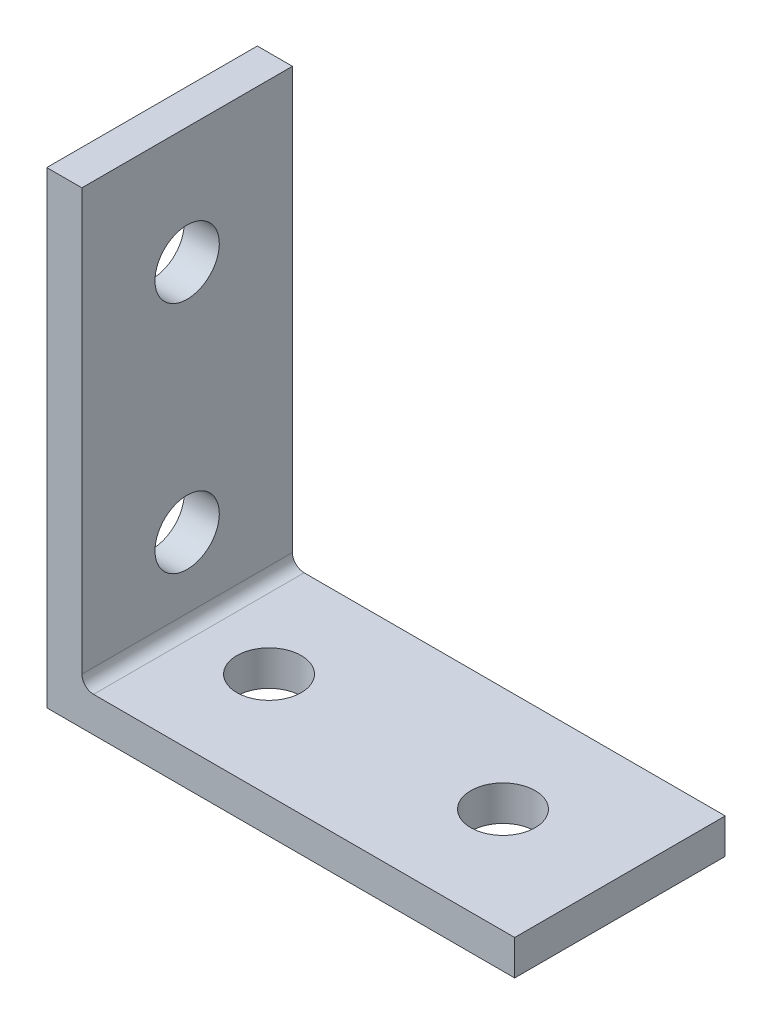
ISO-10303-21;
HEADER;
FILE_DESCRIPTION(('STEP AP214'),'2;1');
FILE_NAME('part.step','',(''),(''),'','','');
FILE_SCHEMA(('AUTOMOTIVE_DESIGN { 1 0 10303 214 1 1 1 1 }'));
ENDSEC;
DATA;
#1=APPLICATION_CONTEXT('core data for automotive mechanical design processes');
#2=APPLICATION_PROTOCOL_DEFINITION('international standard','automotive_design',2000,#1);
#3=PRODUCT_CONTEXT('',#1,'mechanical');
#4=PRODUCT('Part','Part','',(#3));
#5=PRODUCT_RELATED_PRODUCT_CATEGORY('part','',(#4));
#6=PRODUCT_DEFINITION_FORMATION('','',#4);
#7=PRODUCT_DEFINITION_CONTEXT('part definition',#1,'design');
#8=PRODUCT_DEFINITION('design','',#6,#7);
#9=PRODUCT_DEFINITION_SHAPE('','',#8);
#10=(LENGTH_UNIT() NAMED_UNIT(*) SI_UNIT(.MILLI.,.METRE.));
#11=(NAMED_UNIT(*) PLANE_ANGLE_UNIT() SI_UNIT($,.RADIAN.));
#12=(NAMED_UNIT(*) SI_UNIT($,.STERADIAN.) SOLID_ANGLE_UNIT());
#13=UNCERTAINTY_MEASURE_WITH_UNIT(LENGTH_MEASURE(1.E-05),#10,'distance_accuracy_value','');
#14=(GEOMETRIC_REPRESENTATION_CONTEXT(3) GLOBAL_UNCERTAINTY_ASSIGNED_CONTEXT((#13)) GLOBAL_UNIT_ASSIGNED_CONTEXT((#10,
#11,#12)) REPRESENTATION_CONTEXT('',''));
#15=CARTESIAN_POINT('',(0.,0.,0.));
#16=DIRECTION('',(0.,0.,1.));
#17=DIRECTION('',(1.,0.,0.));
#18=AXIS2_PLACEMENT_3D('',#15,#16,#17);
#19=CARTESIAN_POINT('',(40.,0.,9.));
#20=DIRECTION('',(0.,1.,0.));
#21=DIRECTION('',(-1.,0.,0.));
#22=AXIS2_PLACEMENT_3D('',#19,#20,#21);
#23=PLANE('',#22);
#24=CARTESIAN_POINT('',(30.,0.,0.));
#25=DIRECTION('',(0.,1.,0.));
#26=DIRECTION('',(-1.,0.,0.));
#27=AXIS2_PLACEMENT_3D('',#24,#25,#26);
#28=CIRCLE('',#27,2.75);
#29=CARTESIAN_POINT('',(27.25,0.,0.));
#30=VERTEX_POINT('',#29);
#31=EDGE_CURVE('E174',#30,#30,#28,.T.);
#32=ORIENTED_EDGE('',*,*,#31,.T.);
#33=EDGE_LOOP('',(#32));
#34=FACE_BOUND('',#33,.T.);
#35=CARTESIAN_POINT('',(10.,0.,0.));
#36=DIRECTION('',(0.,1.,0.));
#37=DIRECTION('',(-1.,0.,0.));
#38=AXIS2_PLACEMENT_3D('',#35,#36,#37);
#39=CIRCLE('',#38,2.75);
#40=CARTESIAN_POINT('',(7.25,0.,0.));
#41=VERTEX_POINT('',#40);
#42=EDGE_CURVE('E168',#41,#41,#39,.T.);
#43=ORIENTED_EDGE('',*,*,#42,.T.);
#44=EDGE_LOOP('',(#43));
#45=FACE_BOUND('',#44,.T.);
#46=DIRECTION('',(1.,0.,0.));
#47=VECTOR('',#46,1.);
#48=CARTESIAN_POINT('',(40.,0.,-9.));
#49=LINE('',#48,#47);
#50=CARTESIAN_POINT('',(0.,0.,-9.));
#51=VERTEX_POINT('',#50);
#52=CARTESIAN_POINT('',(40.,0.,-9.));
#53=VERTEX_POINT('',#52);
#54=EDGE_CURVE('E123',#51,#53,#49,.T.);
#55=ORIENTED_EDGE('',*,*,#54,.T.);
#56=DIRECTION('',(0.,0.,-1.));
#57=VECTOR('',#56,1.);
#58=CARTESIAN_POINT('',(40.,0.,9.));
#59=LINE('',#58,#57);
#60=CARTESIAN_POINT('',(40.,0.,9.));
#61=VERTEX_POINT('',#60);
#62=EDGE_CURVE('E11',#61,#53,#59,.T.);
#63=ORIENTED_EDGE('',*,*,#62,.F.);
#64=DIRECTION('',(1.,0.,0.));
#65=VECTOR('',#64,1.);
#66=CARTESIAN_POINT('',(40.,0.,9.));
#67=LINE('',#66,#65);
#68=CARTESIAN_POINT('',(0.,0.,9.));
#69=VERTEX_POINT('',#68);
#70=EDGE_CURVE('E136',#69,#61,#67,.T.);
#71=ORIENTED_EDGE('',*,*,#70,.F.);
#72=DIRECTION('',(0.,0.,-1.));
#73=VECTOR('',#72,1.);
#74=CARTESIAN_POINT('',(0.,0.,9.));
#75=LINE('',#74,#73);
#76=EDGE_CURVE('E119',#69,#51,#75,.T.);
#77=ORIENTED_EDGE('',*,*,#76,.T.);
#78=EDGE_LOOP('',(#55,#63,#71,#77));
#79=FACE_BOUND('',#78,.T.);
#80=ADVANCED_FACE('F33',(#34,#45,#79),#23,.F.);
#81=CARTESIAN_POINT('',(40.,3.,9.));
#82=DIRECTION('',(-1.,0.,0.));
#83=DIRECTION('',(0.,0.,1.));
#84=AXIS2_PLACEMENT_3D('',#81,#82,#83);
#85=PLANE('',#84);
#86=DIRECTION('',(0.,1.,0.));
#87=VECTOR('',#86,1.);
#88=CARTESIAN_POINT('',(40.,3.,-9.));
#89=LINE('',#88,#87);
#90=CARTESIAN_POINT('',(40.,3.,-9.));
#91=VERTEX_POINT('',#90);
#92=EDGE_CURVE('E126',#53,#91,#89,.T.);
#93=ORIENTED_EDGE('',*,*,#92,.T.);
#94=DIRECTION('',(0.,0.,-1.));
#95=VECTOR('',#94,1.);
#96=CARTESIAN_POINT('',(40.,3.,9.));
#97=LINE('',#96,#95);
#98=CARTESIAN_POINT('',(40.,3.,9.));
#99=VERTEX_POINT('',#98);
#100=EDGE_CURVE('E41',#99,#91,#97,.T.);
#101=ORIENTED_EDGE('',*,*,#100,.F.);
#102=DIRECTION('',(0.,1.,0.));
#103=VECTOR('',#102,1.);
#104=CARTESIAN_POINT('',(40.,3.,9.));
#105=LINE('',#104,#103);
#106=EDGE_CURVE('E89',#61,#99,#105,.T.);
#107=ORIENTED_EDGE('',*,*,#106,.F.);
#108=ORIENTED_EDGE('',*,*,#62,.T.);
#109=EDGE_LOOP('',(#93,#101,#107,#108));
#110=FACE_BOUND('',#109,.T.);
#111=ADVANCED_FACE('F194',(#110),#85,.F.);
#112=CARTESIAN_POINT('',(4.00000000000001,3.,9.));
#113=DIRECTION('',(0.,-1.,0.));
#114=DIRECTION('',(1.,0.,0.));
#115=AXIS2_PLACEMENT_3D('',#112,#113,#114);
#116=PLANE('',#115);
#117=CARTESIAN_POINT('',(30.,3.,0.));
#118=DIRECTION('',(0.,1.,0.));
#119=DIRECTION('',(-1.,0.,0.));
#120=AXIS2_PLACEMENT_3D('',#117,#118,#119);
#121=CIRCLE('',#120,2.75);
#122=CARTESIAN_POINT('',(27.25,3.,0.));
#123=VERTEX_POINT('',#122);
#124=EDGE_CURVE('E177',#123,#123,#121,.T.);
#125=ORIENTED_EDGE('',*,*,#124,.F.);
#126=EDGE_LOOP('',(#125));
#127=FACE_BOUND('',#126,.T.);
#128=CARTESIAN_POINT('',(10.,3.,0.));
#129=DIRECTION('',(0.,1.,0.));
#130=DIRECTION('',(-1.,0.,0.));
#131=AXIS2_PLACEMENT_3D('',#128,#129,#130);
#132=CIRCLE('',#131,2.75);
#133=CARTESIAN_POINT('',(7.25,3.,0.));
#134=VERTEX_POINT('',#133);
#135=EDGE_CURVE('E171',#134,#134,#132,.T.);
#136=ORIENTED_EDGE('',*,*,#135,.F.);
#137=EDGE_LOOP('',(#136));
#138=FACE_BOUND('',#137,.T.);
#139=DIRECTION('',(-1.,0.,0.));
#140=VECTOR('',#139,1.);
#141=CARTESIAN_POINT('',(4.00000000000001,3.,-9.));
#142=LINE('',#141,#140);
#143=CARTESIAN_POINT('',(4.00000000000001,3.,-9.));
#144=VERTEX_POINT('',#143);
#145=EDGE_CURVE('E129',#91,#144,#142,.T.);
#146=ORIENTED_EDGE('',*,*,#145,.T.);
#147=DIRECTION('',(0.,0.,-1.));
#148=VECTOR('',#147,1.);
#149=CARTESIAN_POINT('',(4.00000000000001,3.,9.));
#150=LINE('',#149,#148);
#151=CARTESIAN_POINT('',(4.00000000000001,3.,9.));
#152=VERTEX_POINT('',#151);
#153=EDGE_CURVE('E140',#152,#144,#150,.T.);
#154=ORIENTED_EDGE('',*,*,#153,.F.);
#155=DIRECTION('',(-1.,0.,0.));
#156=VECTOR('',#155,1.);
#157=CARTESIAN_POINT('',(4.00000000000001,3.,9.));
#158=LINE('',#157,#156);
#159=EDGE_CURVE('E148',#99,#152,#158,.T.);
#160=ORIENTED_EDGE('',*,*,#159,.F.);
#161=ORIENTED_EDGE('',*,*,#100,.T.);
#162=EDGE_LOOP('',(#146,#154,#160,#161));
#163=FACE_BOUND('',#162,.T.);
#164=ADVANCED_FACE('F146',(#127,#138,#163),#116,.F.);
#165=CARTESIAN_POINT('',(4.,4.,9.));
#166=DIRECTION('',(0.,0.,-1.));
#167=DIRECTION('',(-1.,0.,0.));
#168=AXIS2_PLACEMENT_3D('',#165,#166,#167);
#169=CYLINDRICAL_SURFACE('',#168,1.);
#170=CARTESIAN_POINT('',(4.,4.,-9.));
#171=DIRECTION('',(0.,0.,-1.));
#172=DIRECTION('',(-1.,0.,0.));
#173=AXIS2_PLACEMENT_3D('',#170,#171,#172);
#174=CIRCLE('',#173,1.);
#175=CARTESIAN_POINT('',(3.,4.00000000000001,-9.));
#176=VERTEX_POINT('',#175);
#177=EDGE_CURVE('E131',#144,#176,#174,.T.);
#178=ORIENTED_EDGE('',*,*,#177,.T.);
#179=DIRECTION('',(0.,0.,-1.));
#180=VECTOR('',#179,1.);
#181=CARTESIAN_POINT('',(3.,4.00000000000001,9.));
#182=LINE('',#181,#180);
#183=CARTESIAN_POINT('',(3.,4.00000000000001,9.));
#184=VERTEX_POINT('',#183);
#185=EDGE_CURVE('E114',#184,#176,#182,.T.);
#186=ORIENTED_EDGE('',*,*,#185,.F.);
#187=CARTESIAN_POINT('',(4.,4.,9.));
#188=DIRECTION('',(0.,0.,-1.));
#189=DIRECTION('',(-1.,0.,0.));
#190=AXIS2_PLACEMENT_3D('',#187,#188,#189);
#191=CIRCLE('',#190,1.);
#192=EDGE_CURVE('E105',#152,#184,#191,.T.);
#193=ORIENTED_EDGE('',*,*,#192,.F.);
#194=ORIENTED_EDGE('',*,*,#153,.T.);
#195=EDGE_LOOP('',(#178,#186,#193,#194));
#196=FACE_BOUND('',#195,.T.);
#197=ADVANCED_FACE('F154',(#196),#169,.F.);
#198=CARTESIAN_POINT('',(3.,40.,9.));
#199=DIRECTION('',(-1.,0.,0.));
#200=DIRECTION('',(0.,-1.,0.));
#201=AXIS2_PLACEMENT_3D('',#198,#199,#200);
#202=PLANE('',#201);
#203=CARTESIAN_POINT('',(3.,30.,0.));
#204=DIRECTION('',(1.,0.,0.));
#205=DIRECTION('',(0.,1.,0.));
#206=AXIS2_PLACEMENT_3D('',#203,#204,#205);
#207=CIRCLE('',#206,2.75);
#208=CARTESIAN_POINT('',(3.,32.75,0.));
#209=VERTEX_POINT('',#208);
#210=EDGE_CURVE('E165',#209,#209,#207,.T.);
#211=ORIENTED_EDGE('',*,*,#210,.F.);
#212=EDGE_LOOP('',(#211));
#213=FACE_BOUND('',#212,.T.);
#214=CARTESIAN_POINT('',(3.,9.99999999999999,0.));
#215=DIRECTION('',(1.,0.,0.));
#216=DIRECTION('',(0.,1.,0.));
#217=AXIS2_PLACEMENT_3D('',#214,#215,#216);
#218=CIRCLE('',#217,2.75);
#219=CARTESIAN_POINT('',(3.,12.75,0.));
#220=VERTEX_POINT('',#219);
#221=EDGE_CURVE('E159',#220,#220,#218,.T.);
#222=ORIENTED_EDGE('',*,*,#221,.F.);
#223=EDGE_LOOP('',(#222));
#224=FACE_BOUND('',#223,.T.);
#225=DIRECTION('',(0.,1.,0.));
#226=VECTOR('',#225,1.);
#227=CARTESIAN_POINT('',(3.,40.,-9.));
#228=LINE('',#227,#226);
#229=CARTESIAN_POINT('',(3.,40.,-9.));
#230=VERTEX_POINT('',#229);
#231=EDGE_CURVE('E113',#176,#230,#228,.T.);
#232=ORIENTED_EDGE('',*,*,#231,.T.);
#233=DIRECTION('',(0.,0.,-1.));
#234=VECTOR('',#233,1.);
#235=CARTESIAN_POINT('',(3.,40.,9.));
#236=LINE('',#235,#234);
#237=CARTESIAN_POINT('',(3.,40.,9.));
#238=VERTEX_POINT('',#237);
#239=EDGE_CURVE('E110',#238,#230,#236,.T.);
#240=ORIENTED_EDGE('',*,*,#239,.F.);
#241=DIRECTION('',(0.,1.,0.));
#242=VECTOR('',#241,1.);
#243=CARTESIAN_POINT('',(3.,40.,9.));
#244=LINE('',#243,#242);
#245=EDGE_CURVE('E99',#184,#238,#244,.T.);
#246=ORIENTED_EDGE('',*,*,#245,.F.);
#247=ORIENTED_EDGE('',*,*,#185,.T.);
#248=EDGE_LOOP('',(#232,#240,#246,#247));
#249=FACE_BOUND('',#248,.T.);
#250=ADVANCED_FACE('F111',(#213,#224,#249),#202,.F.);
#251=CARTESIAN_POINT('',(0.,40.,9.));
#252=DIRECTION('',(0.,-1.,0.));
#253=DIRECTION('',(0.,0.,-1.));
#254=AXIS2_PLACEMENT_3D('',#251,#252,#253);
#255=PLANE('',#254);
#256=DIRECTION('',(-1.,0.,0.));
#257=VECTOR('',#256,1.);
#258=CARTESIAN_POINT('',(0.,40.,-9.));
#259=LINE('',#258,#257);
#260=CARTESIAN_POINT('',(0.,40.,-9.));
#261=VERTEX_POINT('',#260);
#262=EDGE_CURVE('E75',#230,#261,#259,.T.);
#263=ORIENTED_EDGE('',*,*,#262,.T.);
#264=DIRECTION('',(0.,0.,-1.));
#265=VECTOR('',#264,1.);
#266=CARTESIAN_POINT('',(0.,40.,9.));
#267=LINE('',#266,#265);
#268=CARTESIAN_POINT('',(0.,40.,9.));
#269=VERTEX_POINT('',#268);
#270=EDGE_CURVE('E115',#269,#261,#267,.T.);
#271=ORIENTED_EDGE('',*,*,#270,.F.);
#272=DIRECTION('',(-1.,0.,0.));
#273=VECTOR('',#272,1.);
#274=CARTESIAN_POINT('',(0.,40.,9.));
#275=LINE('',#274,#273);
#276=EDGE_CURVE('E103',#238,#269,#275,.T.);
#277=ORIENTED_EDGE('',*,*,#276,.F.);
#278=ORIENTED_EDGE('',*,*,#239,.T.);
#279=EDGE_LOOP('',(#263,#271,#277,#278));
#280=FACE_BOUND('',#279,.T.);
#281=ADVANCED_FACE('F117',(#280),#255,.F.);
#282=CARTESIAN_POINT('',(0.,0.,9.));
#283=DIRECTION('',(1.,0.,0.));
#284=DIRECTION('',(0.,0.,-1.));
#285=AXIS2_PLACEMENT_3D('',#282,#283,#284);
#286=PLANE('',#285);
#287=CARTESIAN_POINT('',(0.,30.,0.));
#288=DIRECTION('',(1.,0.,0.));
#289=DIRECTION('',(0.,1.,0.));
#290=AXIS2_PLACEMENT_3D('',#287,#288,#289);
#291=CIRCLE('',#290,2.75);
#292=CARTESIAN_POINT('',(0.,32.75,0.));
#293=VERTEX_POINT('',#292);
#294=EDGE_CURVE('E162',#293,#293,#291,.T.);
#295=ORIENTED_EDGE('',*,*,#294,.T.);
#296=EDGE_LOOP('',(#295));
#297=FACE_BOUND('',#296,.T.);
#298=CARTESIAN_POINT('',(0.,9.99999999999999,0.));
#299=DIRECTION('',(1.,0.,0.));
#300=DIRECTION('',(0.,1.,0.));
#301=AXIS2_PLACEMENT_3D('',#298,#299,#300);
#302=CIRCLE('',#301,2.75);
#303=CARTESIAN_POINT('',(0.,12.75,0.));
#304=VERTEX_POINT('',#303);
#305=EDGE_CURVE('E127',#304,#304,#302,.T.);
#306=ORIENTED_EDGE('',*,*,#305,.T.);
#307=EDGE_LOOP('',(#306));
#308=FACE_BOUND('',#307,.T.);
#309=DIRECTION('',(0.,-1.,0.));
#310=VECTOR('',#309,1.);
#311=CARTESIAN_POINT('',(0.,0.,-9.));
#312=LINE('',#311,#310);
#313=EDGE_CURVE('E81',#261,#51,#312,.T.);
#314=ORIENTED_EDGE('',*,*,#313,.T.);
#315=ORIENTED_EDGE('',*,*,#76,.F.);
#316=DIRECTION('',(0.,-1.,0.));
#317=VECTOR('',#316,1.);
#318=CARTESIAN_POINT('',(0.,0.,9.));
#319=LINE('',#318,#317);
#320=EDGE_CURVE('E49',#269,#69,#319,.T.);
#321=ORIENTED_EDGE('',*,*,#320,.F.);
#322=ORIENTED_EDGE('',*,*,#270,.T.);
#323=EDGE_LOOP('',(#314,#315,#321,#322));
#324=FACE_BOUND('',#323,.T.);
#325=ADVANCED_FACE('F223',(#297,#308,#324),#286,.F.);
#326=CARTESIAN_POINT('',(4.,4.,9.));
#327=DIRECTION('',(0.,0.,-1.));
#328=DIRECTION('',(-1.,0.,0.));
#329=AXIS2_PLACEMENT_3D('',#326,#327,#328);
#330=PLANE('',#329);
#331=ORIENTED_EDGE('',*,*,#70,.T.);
#332=ORIENTED_EDGE('',*,*,#106,.T.);
#333=ORIENTED_EDGE('',*,*,#159,.T.);
#334=ORIENTED_EDGE('',*,*,#192,.T.);
#335=ORIENTED_EDGE('',*,*,#245,.T.);
#336=ORIENTED_EDGE('',*,*,#276,.T.);
#337=ORIENTED_EDGE('',*,*,#320,.T.);
#338=EDGE_LOOP('',(#331,#332,#333,#334,#335,#336,#337));
#339=FACE_BOUND('',#338,.T.);
#340=ADVANCED_FACE('F101',(#339),#330,.F.);
#341=CARTESIAN_POINT('',(4.,4.,-9.));
#342=DIRECTION('',(0.,0.,-1.));
#343=DIRECTION('',(-1.,0.,0.));
#344=AXIS2_PLACEMENT_3D('',#341,#342,#343);
#345=PLANE('',#344);
#346=ORIENTED_EDGE('',*,*,#54,.F.);
#347=ORIENTED_EDGE('',*,*,#313,.F.);
#348=ORIENTED_EDGE('',*,*,#262,.F.);
#349=ORIENTED_EDGE('',*,*,#231,.F.);
#350=ORIENTED_EDGE('',*,*,#177,.F.);
#351=ORIENTED_EDGE('',*,*,#145,.F.);
#352=ORIENTED_EDGE('',*,*,#92,.F.);
#353=EDGE_LOOP('',(#346,#347,#348,#349,#350,#351,#352));
#354=FACE_BOUND('',#353,.T.);
#355=ADVANCED_FACE('F152',(#354),#345,.T.);
#356=CARTESIAN_POINT('',(0.,9.99999999999999,0.));
#357=DIRECTION('',(1.,0.,0.));
#358=DIRECTION('',(0.,1.,0.));
#359=AXIS2_PLACEMENT_3D('',#356,#357,#358);
#360=CYLINDRICAL_SURFACE('',#359,2.75);
#361=ORIENTED_EDGE('',*,*,#305,.F.);
#362=EDGE_LOOP('',(#361));
#363=FACE_BOUND('',#362,.T.);
#364=ORIENTED_EDGE('',*,*,#221,.T.);
#365=EDGE_LOOP('',(#364));
#366=FACE_BOUND('',#365,.T.);
#367=ADVANCED_FACE('F205',(#363,#366),#360,.F.);
#368=CARTESIAN_POINT('',(0.,30.,0.));
#369=DIRECTION('',(1.,0.,0.));
#370=DIRECTION('',(0.,1.,0.));
#371=AXIS2_PLACEMENT_3D('',#368,#369,#370);
#372=CYLINDRICAL_SURFACE('',#371,2.75);
#373=ORIENTED_EDGE('',*,*,#294,.F.);
#374=EDGE_LOOP('',(#373));
#375=FACE_BOUND('',#374,.T.);
#376=ORIENTED_EDGE('',*,*,#210,.T.);
#377=EDGE_LOOP('',(#376));
#378=FACE_BOUND('',#377,.T.);
#379=ADVANCED_FACE('F199',(#375,#378),#372,.F.);
#380=CARTESIAN_POINT('',(10.,0.,0.));
#381=DIRECTION('',(0.,1.,0.));
#382=DIRECTION('',(-1.,0.,0.));
#383=AXIS2_PLACEMENT_3D('',#380,#381,#382);
#384=CYLINDRICAL_SURFACE('',#383,2.75);
#385=ORIENTED_EDGE('',*,*,#42,.F.);
#386=EDGE_LOOP('',(#385));
#387=FACE_BOUND('',#386,.T.);
#388=ORIENTED_EDGE('',*,*,#135,.T.);
#389=EDGE_LOOP('',(#388));
#390=FACE_BOUND('',#389,.T.);
#391=ADVANCED_FACE('F188',(#387,#390),#384,.F.);
#392=CARTESIAN_POINT('',(30.,0.,0.));
#393=DIRECTION('',(0.,1.,0.));
#394=DIRECTION('',(-1.,0.,0.));
#395=AXIS2_PLACEMENT_3D('',#392,#393,#394);
#396=CYLINDRICAL_SURFACE('',#395,2.75);
#397=ORIENTED_EDGE('',*,*,#31,.F.);
#398=EDGE_LOOP('',(#397));
#399=FACE_BOUND('',#398,.T.);
#400=ORIENTED_EDGE('',*,*,#124,.T.);
#401=EDGE_LOOP('',(#400));
#402=FACE_BOUND('',#401,.T.);
#403=ADVANCED_FACE('F185',(#399,#402),#396,.F.);
#404=CLOSED_SHELL('',(#80,#111,#164,#197,#250,#281,#325,#340,#355,#367,#379,#391,#403));
#405=MANIFOLD_SOLID_BREP('B2',#404);
#406=ADVANCED_BREP_SHAPE_REPRESENTATION('',(#18,#405),#14);
#407=SHAPE_DEFINITION_REPRESENTATION(#9,#406);
ENDSEC;
END-ISO-10303-21;
